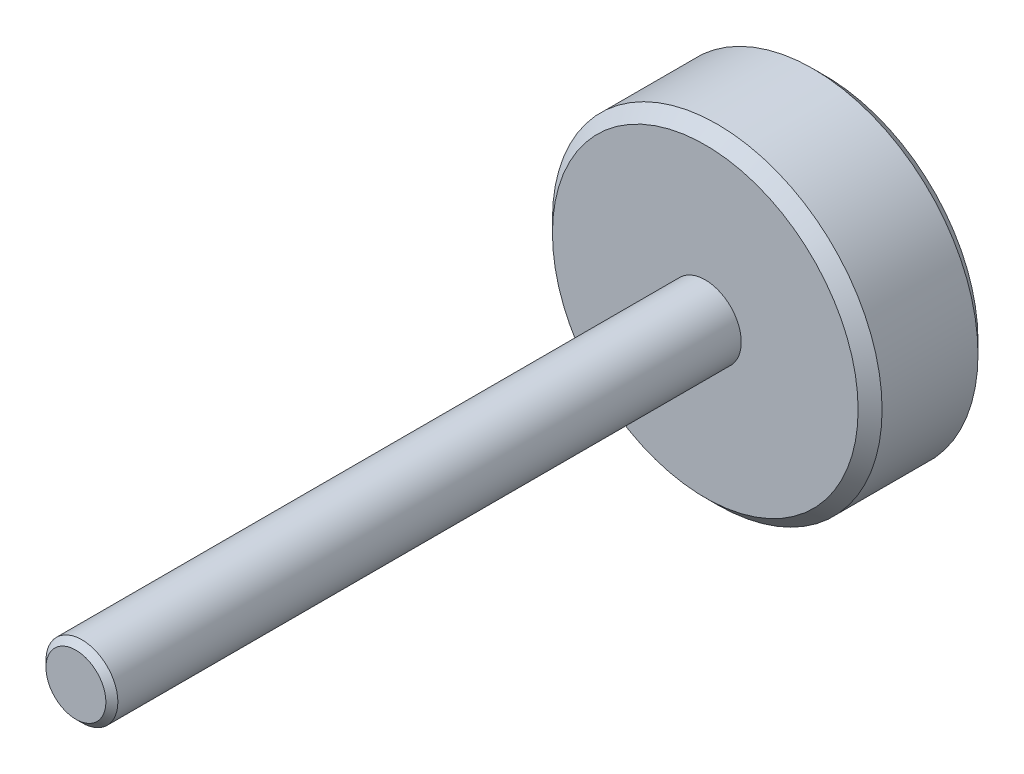
ISO-10303-21;
HEADER;
FILE_DESCRIPTION(('STEP AP214'),'2;1');
FILE_NAME('part.step','',(''),(''),'','','');
FILE_SCHEMA(('AUTOMOTIVE_DESIGN { 1 0 10303 214 1 1 1 1 }'));
ENDSEC;
DATA;
#1=APPLICATION_CONTEXT('core data for automotive mechanical design processes');
#2=APPLICATION_PROTOCOL_DEFINITION('international standard','automotive_design',2000,#1);
#3=PRODUCT_CONTEXT('',#1,'mechanical');
#4=PRODUCT('Part','Part','',(#3));
#5=PRODUCT_RELATED_PRODUCT_CATEGORY('part','',(#4));
#6=PRODUCT_DEFINITION_FORMATION('','',#4);
#7=PRODUCT_DEFINITION_CONTEXT('part definition',#1,'design');
#8=PRODUCT_DEFINITION('design','',#6,#7);
#9=PRODUCT_DEFINITION_SHAPE('','',#8);
#10=(LENGTH_UNIT() NAMED_UNIT(*) SI_UNIT(.MILLI.,.METRE.));
#11=(NAMED_UNIT(*) PLANE_ANGLE_UNIT() SI_UNIT($,.RADIAN.));
#12=(NAMED_UNIT(*) SI_UNIT($,.STERADIAN.) SOLID_ANGLE_UNIT());
#13=UNCERTAINTY_MEASURE_WITH_UNIT(LENGTH_MEASURE(1.E-05),#10,'distance_accuracy_value','');
#14=(GEOMETRIC_REPRESENTATION_CONTEXT(3) GLOBAL_UNCERTAINTY_ASSIGNED_CONTEXT((#13)) GLOBAL_UNIT_ASSIGNED_CONTEXT((#10,
#11,#12)) REPRESENTATION_CONTEXT('',''));
#15=CARTESIAN_POINT('',(0.,0.,0.));
#16=DIRECTION('',(0.,0.,1.));
#17=DIRECTION('',(1.,0.,0.));
#18=AXIS2_PLACEMENT_3D('',#15,#16,#17);
#19=CARTESIAN_POINT('',(0.,0.,20.));
#20=DIRECTION('',(0.,0.,-1.));
#21=DIRECTION('',(-1.,0.,0.));
#22=AXIS2_PLACEMENT_3D('',#19,#20,#21);
#23=CYLINDRICAL_SURFACE('',#22,27.5);
#24=CARTESIAN_POINT('',(0.,0.,2.));
#25=DIRECTION('',(0.,0.,1.));
#26=DIRECTION('',(1.,0.,0.));
#27=AXIS2_PLACEMENT_3D('',#24,#25,#26);
#28=CIRCLE('',#27,27.5);
#29=CARTESIAN_POINT('',(27.5,0.,2.));
#30=VERTEX_POINT('',#29);
#31=EDGE_CURVE('E48',#30,#30,#28,.T.);
#32=ORIENTED_EDGE('',*,*,#31,.T.);
#33=EDGE_LOOP('',(#32));
#34=FACE_BOUND('',#33,.T.);
#35=CARTESIAN_POINT('',(0.,0.,18.));
#36=DIRECTION('',(0.,0.,1.));
#37=DIRECTION('',(1.,0.,0.));
#38=AXIS2_PLACEMENT_3D('',#35,#36,#37);
#39=CIRCLE('',#38,27.5);
#40=CARTESIAN_POINT('',(27.5,0.,18.));
#41=VERTEX_POINT('',#40);
#42=EDGE_CURVE('E52',#41,#41,#39,.F.);
#43=ORIENTED_EDGE('',*,*,#42,.T.);
#44=EDGE_LOOP('',(#43));
#45=FACE_BOUND('',#44,.T.);
#46=ADVANCED_FACE('F36',(#34,#45),#23,.T.);
#47=CARTESIAN_POINT('',(0.,0.,20.));
#48=DIRECTION('',(0.,0.,1.));
#49=DIRECTION('',(1.,0.,0.));
#50=AXIS2_PLACEMENT_3D('',#47,#48,#49);
#51=PLANE('',#50);
#52=CARTESIAN_POINT('',(0.,0.,20.));
#53=DIRECTION('',(0.,0.,1.));
#54=DIRECTION('',(1.,0.,0.));
#55=AXIS2_PLACEMENT_3D('',#52,#53,#54);
#56=CIRCLE('',#55,25.5);
#57=CARTESIAN_POINT('',(25.5,0.,20.));
#58=VERTEX_POINT('',#57);
#59=EDGE_CURVE('E10',#58,#58,#56,.T.);
#60=ORIENTED_EDGE('',*,*,#59,.T.);
#61=EDGE_LOOP('',(#60));
#62=FACE_BOUND('',#61,.T.);
#63=CARTESIAN_POINT('',(0.,0.,20.));
#64=DIRECTION('',(0.,0.,1.));
#65=DIRECTION('',(1.,0.,0.));
#66=AXIS2_PLACEMENT_3D('',#63,#64,#65);
#67=CIRCLE('',#66,6.);
#68=CARTESIAN_POINT('',(6.,0.,20.));
#69=VERTEX_POINT('',#68);
#70=EDGE_CURVE('E63',#69,#69,#67,.T.);
#71=ORIENTED_EDGE('',*,*,#70,.F.);
#72=EDGE_LOOP('',(#71));
#73=FACE_BOUND('',#72,.T.);
#74=ADVANCED_FACE('F69',(#62,#73),#51,.T.);
#75=CARTESIAN_POINT('',(0.,0.,0.));
#76=DIRECTION('',(0.,0.,1.));
#77=DIRECTION('',(1.,0.,0.));
#78=AXIS2_PLACEMENT_3D('',#75,#76,#77);
#79=PLANE('',#78);
#80=CARTESIAN_POINT('',(0.,0.,0.));
#81=DIRECTION('',(0.,0.,1.));
#82=DIRECTION('',(1.,0.,0.));
#83=AXIS2_PLACEMENT_3D('',#80,#81,#82);
#84=CIRCLE('',#83,25.5);
#85=CARTESIAN_POINT('',(25.5,0.,0.));
#86=VERTEX_POINT('',#85);
#87=EDGE_CURVE('E44',#86,#86,#84,.F.);
#88=ORIENTED_EDGE('',*,*,#87,.T.);
#89=EDGE_LOOP('',(#88));
#90=FACE_BOUND('',#89,.T.);
#91=ADVANCED_FACE('F71',(#90),#79,.F.);
#92=CARTESIAN_POINT('',(0.,0.,125.));
#93=DIRECTION('',(0.,0.,-1.));
#94=DIRECTION('',(-1.,0.,0.));
#95=AXIS2_PLACEMENT_3D('',#92,#93,#94);
#96=CYLINDRICAL_SURFACE('',#95,6.);
#97=CARTESIAN_POINT('',(0.,0.,124.));
#98=DIRECTION('',(0.,0.,1.));
#99=DIRECTION('',(1.,0.,0.));
#100=AXIS2_PLACEMENT_3D('',#97,#98,#99);
#101=CIRCLE('',#100,6.);
#102=CARTESIAN_POINT('',(6.,0.,124.));
#103=VERTEX_POINT('',#102);
#104=EDGE_CURVE('E57',#103,#103,#101,.F.);
#105=ORIENTED_EDGE('',*,*,#104,.T.);
#106=EDGE_LOOP('',(#105));
#107=FACE_BOUND('',#106,.T.);
#108=ORIENTED_EDGE('',*,*,#70,.T.);
#109=EDGE_LOOP('',(#108));
#110=FACE_BOUND('',#109,.T.);
#111=ADVANCED_FACE('F67',(#107,#110),#96,.T.);
#112=CARTESIAN_POINT('',(0.,0.,125.));
#113=DIRECTION('',(0.,0.,1.));
#114=DIRECTION('',(1.,0.,0.));
#115=AXIS2_PLACEMENT_3D('',#112,#113,#114);
#116=PLANE('',#115);
#117=CARTESIAN_POINT('',(0.,0.,125.));
#118=DIRECTION('',(0.,0.,1.));
#119=DIRECTION('',(1.,0.,0.));
#120=AXIS2_PLACEMENT_3D('',#117,#118,#119);
#121=CIRCLE('',#120,5.);
#122=CARTESIAN_POINT('',(5.,0.,125.));
#123=VERTEX_POINT('',#122);
#124=EDGE_CURVE('E60',#123,#123,#121,.T.);
#125=ORIENTED_EDGE('',*,*,#124,.T.);
#126=EDGE_LOOP('',(#125));
#127=FACE_BOUND('',#126,.T.);
#128=ADVANCED_FACE('F90',(#127),#116,.T.);
#129=CARTESIAN_POINT('',(0.,0.,125.));
#130=DIRECTION('',(0.,0.,-1.));
#131=DIRECTION('',(-1.,0.,0.));
#132=AXIS2_PLACEMENT_3D('',#129,#130,#131);
#133=CONICAL_SURFACE('',#132,5.,0.785398163397453);
#134=ORIENTED_EDGE('',*,*,#104,.F.);
#135=EDGE_LOOP('',(#134));
#136=FACE_BOUND('',#135,.T.);
#137=ORIENTED_EDGE('',*,*,#124,.F.);
#138=EDGE_LOOP('',(#137));
#139=FACE_BOUND('',#138,.T.);
#140=ADVANCED_FACE('F84',(#136,#139),#133,.T.);
#141=CARTESIAN_POINT('',(0.,0.,2.));
#142=DIRECTION('',(0.,0.,1.));
#143=DIRECTION('',(1.,0.,0.));
#144=AXIS2_PLACEMENT_3D('',#141,#142,#143);
#145=CONICAL_SURFACE('',#144,27.5,0.785398163397455);
#146=ORIENTED_EDGE('',*,*,#87,.F.);
#147=EDGE_LOOP('',(#146));
#148=FACE_BOUND('',#147,.T.);
#149=ORIENTED_EDGE('',*,*,#31,.F.);
#150=EDGE_LOOP('',(#149));
#151=FACE_BOUND('',#150,.T.);
#152=ADVANCED_FACE('F89',(#148,#151),#145,.T.);
#153=CARTESIAN_POINT('',(0.,0.,20.));
#154=DIRECTION('',(0.,0.,-1.));
#155=DIRECTION('',(-1.,0.,0.));
#156=AXIS2_PLACEMENT_3D('',#153,#154,#155);
#157=CONICAL_SURFACE('',#156,25.5,0.785398163397452);
#158=ORIENTED_EDGE('',*,*,#42,.F.);
#159=EDGE_LOOP('',(#158));
#160=FACE_BOUND('',#159,.T.);
#161=ORIENTED_EDGE('',*,*,#59,.F.);
#162=EDGE_LOOP('',(#161));
#163=FACE_BOUND('',#162,.T.);
#164=ADVANCED_FACE('F39',(#160,#163),#157,.T.);
#165=CLOSED_SHELL('',(#46,#74,#91,#111,#128,#140,#152,#164));
#166=MANIFOLD_SOLID_BREP('B2',#165);
#167=ADVANCED_BREP_SHAPE_REPRESENTATION('',(#18,#166),#14);
#168=SHAPE_DEFINITION_REPRESENTATION(#9,#167);
ENDSEC;
END-ISO-10303-21;
